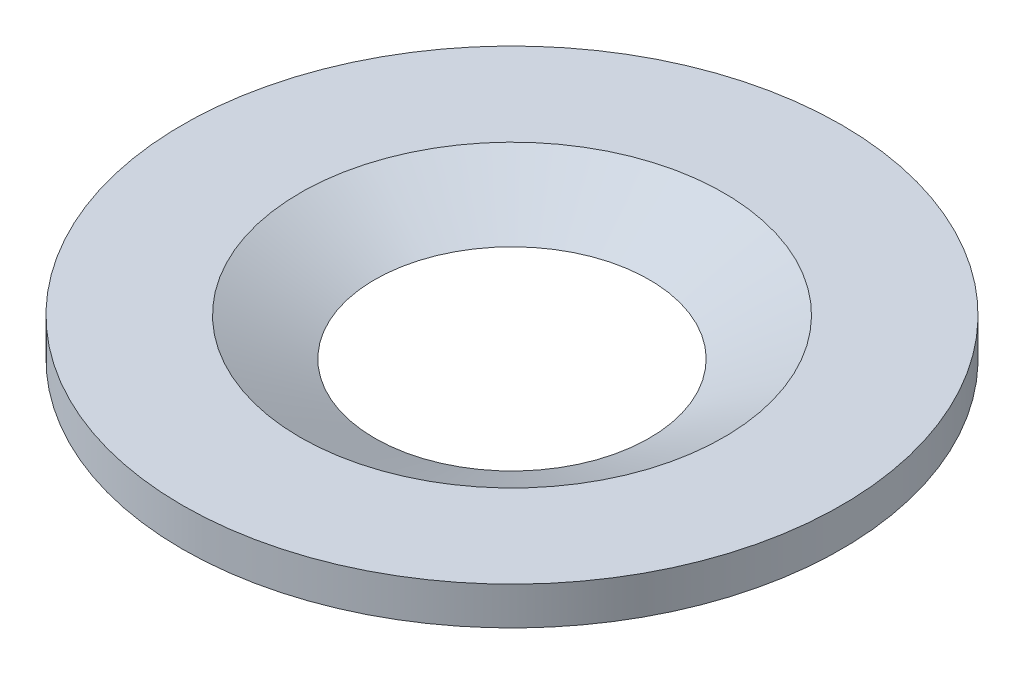
ISO-10303-21;
HEADER;
FILE_DESCRIPTION(('STEP AP214'),'2;1');
FILE_NAME('part.step','',(''),(''),'','','');
FILE_SCHEMA(('AUTOMOTIVE_DESIGN { 1 0 10303 214 1 1 1 1 }'));
ENDSEC;
DATA;
#1=APPLICATION_CONTEXT('core data for automotive mechanical design processes');
#2=APPLICATION_PROTOCOL_DEFINITION('international standard','automotive_design',2000,#1);
#3=PRODUCT_CONTEXT('',#1,'mechanical');
#4=PRODUCT('Part','Part','',(#3));
#5=PRODUCT_RELATED_PRODUCT_CATEGORY('part','',(#4));
#6=PRODUCT_DEFINITION_FORMATION('','',#4);
#7=PRODUCT_DEFINITION_CONTEXT('part definition',#1,'design');
#8=PRODUCT_DEFINITION('design','',#6,#7);
#9=PRODUCT_DEFINITION_SHAPE('','',#8);
#10=(LENGTH_UNIT() NAMED_UNIT(*) SI_UNIT(.MILLI.,.METRE.));
#11=(NAMED_UNIT(*) PLANE_ANGLE_UNIT() SI_UNIT($,.RADIAN.));
#12=(NAMED_UNIT(*) SI_UNIT($,.STERADIAN.) SOLID_ANGLE_UNIT());
#13=UNCERTAINTY_MEASURE_WITH_UNIT(LENGTH_MEASURE(1.E-05),#10,'distance_accuracy_value','');
#14=(GEOMETRIC_REPRESENTATION_CONTEXT(3) GLOBAL_UNCERTAINTY_ASSIGNED_CONTEXT((#13)) GLOBAL_UNIT_ASSIGNED_CONTEXT((#10,
#11,#12)) REPRESENTATION_CONTEXT('',''));
#15=CARTESIAN_POINT('',(0.,0.,0.));
#16=DIRECTION('',(0.,0.,1.));
#17=DIRECTION('',(1.,0.,0.));
#18=AXIS2_PLACEMENT_3D('',#15,#16,#17);
#19=CARTESIAN_POINT('',(0.,9.652,0.));
#20=DIRECTION('',(0.,1.,0.));
#21=DIRECTION('',(0.,0.,1.));
#22=AXIS2_PLACEMENT_3D('',#19,#20,#21);
#23=PLANE('',#22);
#24=CARTESIAN_POINT('',(0.,9.652,0.));
#25=DIRECTION('',(0.,1.,0.));
#26=DIRECTION('',(0.,0.,1.));
#27=AXIS2_PLACEMENT_3D('',#24,#25,#26);
#28=CIRCLE('',#27,53.868116599136);
#29=CARTESIAN_POINT('',(0.,9.652,53.868116599136));
#30=VERTEX_POINT('',#29);
#31=EDGE_CURVE('E45',#30,#30,#28,.T.);
#32=ORIENTED_EDGE('',*,*,#31,.F.);
#33=EDGE_LOOP('',(#32));
#34=FACE_BOUND('',#33,.T.);
#35=CARTESIAN_POINT('',(0.,9.652,0.));
#36=DIRECTION('',(0.,1.,0.));
#37=DIRECTION('',(0.,0.,1.));
#38=AXIS2_PLACEMENT_3D('',#35,#36,#37);
#39=CIRCLE('',#38,83.82);
#40=CARTESIAN_POINT('',(0.,9.652,83.82));
#41=VERTEX_POINT('',#40);
#42=EDGE_CURVE('E10',#41,#41,#39,.T.);
#43=ORIENTED_EDGE('',*,*,#42,.T.);
#44=EDGE_LOOP('',(#43));
#45=FACE_BOUND('',#44,.T.);
#46=ADVANCED_FACE('F34',(#34,#45),#23,.T.);
#47=CARTESIAN_POINT('',(0.,0.,0.));
#48=DIRECTION('',(0.,1.,0.));
#49=DIRECTION('',(0.,0.,1.));
#50=AXIS2_PLACEMENT_3D('',#47,#48,#49);
#51=PLANE('',#50);
#52=CARTESIAN_POINT('',(0.,0.,0.));
#53=DIRECTION('',(0.,1.,0.));
#54=DIRECTION('',(0.,0.,1.));
#55=AXIS2_PLACEMENT_3D('',#52,#53,#54);
#56=CIRCLE('',#55,83.82);
#57=CARTESIAN_POINT('',(0.,0.,83.82));
#58=VERTEX_POINT('',#57);
#59=EDGE_CURVE('E38',#58,#58,#56,.T.);
#60=ORIENTED_EDGE('',*,*,#59,.F.);
#61=EDGE_LOOP('',(#60));
#62=FACE_BOUND('',#61,.T.);
#63=CARTESIAN_POINT('',(0.,0.,0.));
#64=DIRECTION('',(0.,1.,0.));
#65=DIRECTION('',(0.,0.,1.));
#66=AXIS2_PLACEMENT_3D('',#63,#64,#65);
#67=CIRCLE('',#66,34.925);
#68=CARTESIAN_POINT('',(0.,0.,34.925));
#69=VERTEX_POINT('',#68);
#70=EDGE_CURVE('E49',#69,#69,#67,.T.);
#71=ORIENTED_EDGE('',*,*,#70,.T.);
#72=EDGE_LOOP('',(#71));
#73=FACE_BOUND('',#72,.T.);
#74=ADVANCED_FACE('F53',(#62,#73),#51,.F.);
#75=CARTESIAN_POINT('',(0.,9.652,0.));
#76=DIRECTION('',(0.,-1.,0.));
#77=DIRECTION('',(0.,0.,-1.));
#78=AXIS2_PLACEMENT_3D('',#75,#76,#77);
#79=CYLINDRICAL_SURFACE('',#78,83.82);
#80=ORIENTED_EDGE('',*,*,#42,.F.);
#81=EDGE_LOOP('',(#80));
#82=FACE_BOUND('',#81,.T.);
#83=ORIENTED_EDGE('',*,*,#59,.T.);
#84=EDGE_LOOP('',(#83));
#85=FACE_BOUND('',#84,.T.);
#86=ADVANCED_FACE('F36',(#82,#85),#79,.T.);
#87=CARTESIAN_POINT('',(0.,9.652,0.));
#88=DIRECTION('',(0.,1.,0.));
#89=DIRECTION('',(0.,0.,1.));
#90=AXIS2_PLACEMENT_3D('',#87,#88,#89);
#91=CONICAL_SURFACE('',#90,53.868116599136,1.09955742875643);
#92=ORIENTED_EDGE('',*,*,#70,.F.);
#93=EDGE_LOOP('',(#92));
#94=FACE_BOUND('',#93,.T.);
#95=ORIENTED_EDGE('',*,*,#31,.T.);
#96=EDGE_LOOP('',(#95));
#97=FACE_BOUND('',#96,.T.);
#98=ADVANCED_FACE('F55',(#94,#97),#91,.F.);
#99=CLOSED_SHELL('',(#46,#74,#86,#98));
#100=MANIFOLD_SOLID_BREP('B2',#99);
#101=ADVANCED_BREP_SHAPE_REPRESENTATION('',(#18,#100),#14);
#102=SHAPE_DEFINITION_REPRESENTATION(#9,#101);
ENDSEC;
END-ISO-10303-21;
